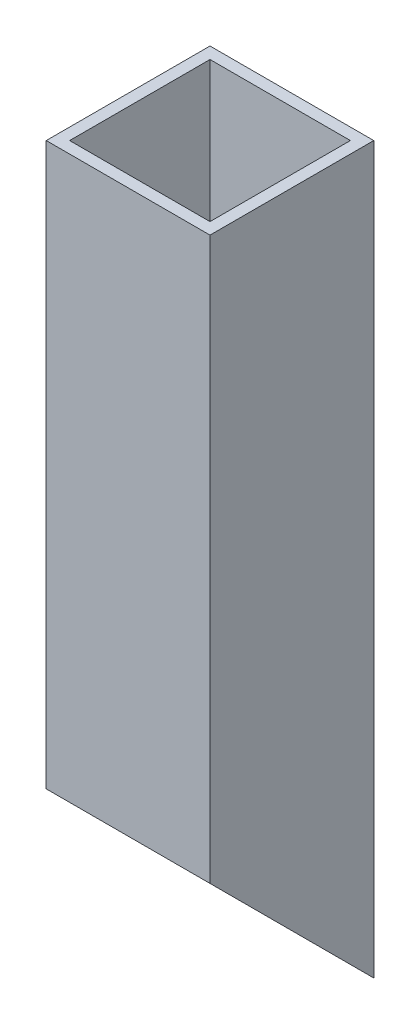
ISO-10303-21;
HEADER;
FILE_DESCRIPTION(('STEP AP214'),'2;1');
FILE_NAME('part.step','',(''),(''),'','','');
FILE_SCHEMA(('AUTOMOTIVE_DESIGN { 1 0 10303 214 1 1 1 1 }'));
ENDSEC;
DATA;
#1=APPLICATION_CONTEXT('core data for automotive mechanical design processes');
#2=APPLICATION_PROTOCOL_DEFINITION('international standard','automotive_design',2000,#1);
#3=PRODUCT_CONTEXT('',#1,'mechanical');
#4=PRODUCT('Part','Part','',(#3));
#5=PRODUCT_RELATED_PRODUCT_CATEGORY('part','',(#4));
#6=PRODUCT_DEFINITION_FORMATION('','',#4);
#7=PRODUCT_DEFINITION_CONTEXT('part definition',#1,'design');
#8=PRODUCT_DEFINITION('design','',#6,#7);
#9=PRODUCT_DEFINITION_SHAPE('','',#8);
#10=(LENGTH_UNIT() NAMED_UNIT(*) SI_UNIT(.MILLI.,.METRE.));
#11=(NAMED_UNIT(*) PLANE_ANGLE_UNIT() SI_UNIT($,.RADIAN.));
#12=(NAMED_UNIT(*) SI_UNIT($,.STERADIAN.) SOLID_ANGLE_UNIT());
#13=UNCERTAINTY_MEASURE_WITH_UNIT(LENGTH_MEASURE(1.E-05),#10,'distance_accuracy_value','');
#14=(GEOMETRIC_REPRESENTATION_CONTEXT(3) GLOBAL_UNCERTAINTY_ASSIGNED_CONTEXT((#13)) GLOBAL_UNIT_ASSIGNED_CONTEXT((#10,
#11,#12)) REPRESENTATION_CONTEXT('',''));
#15=CARTESIAN_POINT('',(0.,0.,0.));
#16=DIRECTION('',(0.,0.,1.));
#17=DIRECTION('',(1.,0.,0.));
#18=AXIS2_PLACEMENT_3D('',#15,#16,#17);
#19=CARTESIAN_POINT('',(0.,196.85,0.));
#20=DIRECTION('',(0.,-1.,0.));
#21=DIRECTION('',(0.,0.,-1.));
#22=AXIS2_PLACEMENT_3D('',#19,#20,#21);
#23=PLANE('',#22);
#24=DIRECTION('',(0.,0.,1.));
#25=VECTOR('',#24,1.);
#26=CARTESIAN_POINT('',(0.,196.85,0.));
#27=LINE('',#26,#25);
#28=CARTESIAN_POINT('',(0.,196.85,-44.45));
#29=VERTEX_POINT('',#28);
#30=CARTESIAN_POINT('',(0.,196.85,0.));
#31=VERTEX_POINT('',#30);
#32=EDGE_CURVE('E124',#29,#31,#27,.T.);
#33=ORIENTED_EDGE('',*,*,#32,.T.);
#34=DIRECTION('',(1.,0.,0.));
#35=VECTOR('',#34,1.);
#36=CARTESIAN_POINT('',(0.,196.85,0.));
#37=LINE('',#36,#35);
#38=CARTESIAN_POINT('',(44.45,196.85,0.));
#39=VERTEX_POINT('',#38);
#40=EDGE_CURVE('E130',#31,#39,#37,.T.);
#41=ORIENTED_EDGE('',*,*,#40,.T.);
#42=DIRECTION('',(0.,0.,-1.));
#43=VECTOR('',#42,1.);
#44=CARTESIAN_POINT('',(44.45,196.85,0.));
#45=LINE('',#44,#43);
#46=CARTESIAN_POINT('',(44.45,196.85,-44.45));
#47=VERTEX_POINT('',#46);
#48=EDGE_CURVE('E127',#39,#47,#45,.T.);
#49=ORIENTED_EDGE('',*,*,#48,.T.);
#50=DIRECTION('',(-1.,0.,0.));
#51=VECTOR('',#50,1.);
#52=CARTESIAN_POINT('',(0.,196.85,-44.45));
#53=LINE('',#52,#51);
#54=EDGE_CURVE('E121',#47,#29,#53,.T.);
#55=ORIENTED_EDGE('',*,*,#54,.T.);
#56=EDGE_LOOP('',(#33,#41,#49,#55));
#57=FACE_BOUND('',#56,.T.);
#58=DIRECTION('',(1.,0.,0.));
#59=VECTOR('',#58,1.);
#60=CARTESIAN_POINT('',(3.175,196.85,-3.175));
#61=LINE('',#60,#59);
#62=CARTESIAN_POINT('',(3.175,196.85,-3.175));
#63=VERTEX_POINT('',#62);
#64=CARTESIAN_POINT('',(41.275,196.85,-3.175));
#65=VERTEX_POINT('',#64);
#66=EDGE_CURVE('E92',#63,#65,#61,.T.);
#67=ORIENTED_EDGE('',*,*,#66,.F.);
#68=DIRECTION('',(0.,0.,1.));
#69=VECTOR('',#68,1.);
#70=CARTESIAN_POINT('',(3.175,196.85,-3.175));
#71=LINE('',#70,#69);
#72=CARTESIAN_POINT('',(3.175,196.85,-41.275));
#73=VERTEX_POINT('',#72);
#74=EDGE_CURVE('E140',#73,#63,#71,.T.);
#75=ORIENTED_EDGE('',*,*,#74,.F.);
#76=DIRECTION('',(-1.,0.,0.));
#77=VECTOR('',#76,1.);
#78=CARTESIAN_POINT('',(3.175,196.85,-41.275));
#79=LINE('',#78,#77);
#80=CARTESIAN_POINT('',(41.275,196.85,-41.275));
#81=VERTEX_POINT('',#80);
#82=EDGE_CURVE('E143',#81,#73,#79,.T.);
#83=ORIENTED_EDGE('',*,*,#82,.F.);
#84=DIRECTION('',(0.,0.,-1.));
#85=VECTOR('',#84,1.);
#86=CARTESIAN_POINT('',(41.275,196.85,-3.175));
#87=LINE('',#86,#85);
#88=EDGE_CURVE('E102',#65,#81,#87,.T.);
#89=ORIENTED_EDGE('',*,*,#88,.F.);
#90=EDGE_LOOP('',(#67,#75,#83,#89));
#91=FACE_BOUND('',#90,.T.);
#92=ADVANCED_FACE('F37',(#57,#91),#23,.F.);
#93=CARTESIAN_POINT('',(0.,196.85,0.));
#94=DIRECTION('',(1.,0.,0.));
#95=DIRECTION('',(0.,0.,-1.));
#96=AXIS2_PLACEMENT_3D('',#93,#94,#95);
#97=PLANE('',#96);
#98=DIRECTION('',(0.,-1.,0.));
#99=VECTOR('',#98,1.);
#100=CARTESIAN_POINT('',(0.,196.85,-44.45));
#101=LINE('',#100,#99);
#102=CARTESIAN_POINT('',(0.,0.,-44.45));
#103=VERTEX_POINT('',#102);
#104=EDGE_CURVE('E119',#29,#103,#101,.T.);
#105=ORIENTED_EDGE('',*,*,#104,.T.);
#106=DIRECTION('',(0.,0.707106781186546,0.707106781186549));
#107=VECTOR('',#106,1.);
#108=CARTESIAN_POINT('',(0.,44.45,0.));
#109=LINE('',#108,#107);
#110=CARTESIAN_POINT('',(0.,44.45,0.));
#111=VERTEX_POINT('',#110);
#112=EDGE_CURVE('E11',#103,#111,#109,.T.);
#113=ORIENTED_EDGE('',*,*,#112,.T.);
#114=DIRECTION('',(0.,-1.,0.));
#115=VECTOR('',#114,1.);
#116=CARTESIAN_POINT('',(0.,196.85,0.));
#117=LINE('',#116,#115);
#118=EDGE_CURVE('E111',#31,#111,#117,.T.);
#119=ORIENTED_EDGE('',*,*,#118,.F.);
#120=ORIENTED_EDGE('',*,*,#32,.F.);
#121=EDGE_LOOP('',(#105,#113,#119,#120));
#122=FACE_BOUND('',#121,.T.);
#123=ADVANCED_FACE('F177',(#122),#97,.F.);
#124=CARTESIAN_POINT('',(0.,196.85,0.));
#125=DIRECTION('',(0.,0.,-1.));
#126=DIRECTION('',(-1.,0.,0.));
#127=AXIS2_PLACEMENT_3D('',#124,#125,#126);
#128=PLANE('',#127);
#129=ORIENTED_EDGE('',*,*,#118,.T.);
#130=DIRECTION('',(1.,0.,0.));
#131=VECTOR('',#130,1.);
#132=CARTESIAN_POINT('',(44.45,44.45,0.));
#133=LINE('',#132,#131);
#134=CARTESIAN_POINT('',(44.45,44.45,0.));
#135=VERTEX_POINT('',#134);
#136=EDGE_CURVE('E108',#111,#135,#133,.T.);
#137=ORIENTED_EDGE('',*,*,#136,.T.);
#138=DIRECTION('',(0.,-1.,0.));
#139=VECTOR('',#138,1.);
#140=CARTESIAN_POINT('',(44.45,196.85,0.));
#141=LINE('',#140,#139);
#142=EDGE_CURVE('E113',#39,#135,#141,.T.);
#143=ORIENTED_EDGE('',*,*,#142,.F.);
#144=ORIENTED_EDGE('',*,*,#40,.F.);
#145=EDGE_LOOP('',(#129,#137,#143,#144));
#146=FACE_BOUND('',#145,.T.);
#147=ADVANCED_FACE('F181',(#146),#128,.F.);
#148=CARTESIAN_POINT('',(44.45,196.85,0.));
#149=DIRECTION('',(-1.,0.,0.));
#150=DIRECTION('',(0.,0.,1.));
#151=AXIS2_PLACEMENT_3D('',#148,#149,#150);
#152=PLANE('',#151);
#153=ORIENTED_EDGE('',*,*,#142,.T.);
#154=DIRECTION('',(0.,-0.707106781186546,-0.707106781186549));
#155=VECTOR('',#154,1.);
#156=CARTESIAN_POINT('',(44.45,44.45,0.));
#157=LINE('',#156,#155);
#158=CARTESIAN_POINT('',(44.45,0.,-44.45));
#159=VERTEX_POINT('',#158);
#160=EDGE_CURVE('E47',#135,#159,#157,.T.);
#161=ORIENTED_EDGE('',*,*,#160,.T.);
#162=DIRECTION('',(0.,-1.,0.));
#163=VECTOR('',#162,1.);
#164=CARTESIAN_POINT('',(44.45,196.85,-44.45));
#165=LINE('',#164,#163);
#166=EDGE_CURVE('E116',#47,#159,#165,.T.);
#167=ORIENTED_EDGE('',*,*,#166,.F.);
#168=ORIENTED_EDGE('',*,*,#48,.F.);
#169=EDGE_LOOP('',(#153,#161,#167,#168));
#170=FACE_BOUND('',#169,.T.);
#171=ADVANCED_FACE('F184',(#170),#152,.F.);
#172=CARTESIAN_POINT('',(0.,196.85,-44.45));
#173=DIRECTION('',(0.,0.,1.));
#174=DIRECTION('',(1.,0.,0.));
#175=AXIS2_PLACEMENT_3D('',#172,#173,#174);
#176=PLANE('',#175);
#177=DIRECTION('',(-1.,0.,0.));
#178=VECTOR('',#177,1.);
#179=CARTESIAN_POINT('',(0.,0.,-44.45));
#180=LINE('',#179,#178);
#181=EDGE_CURVE('E93',#159,#103,#180,.T.);
#182=ORIENTED_EDGE('',*,*,#181,.T.);
#183=ORIENTED_EDGE('',*,*,#104,.F.);
#184=ORIENTED_EDGE('',*,*,#54,.F.);
#185=ORIENTED_EDGE('',*,*,#166,.T.);
#186=EDGE_LOOP('',(#182,#183,#184,#185));
#187=FACE_BOUND('',#186,.T.);
#188=ADVANCED_FACE('F172',(#187),#176,.F.);
#189=CARTESIAN_POINT('',(3.175,196.85,-3.175));
#190=DIRECTION('',(0.,0.,-1.));
#191=DIRECTION('',(-1.,0.,0.));
#192=AXIS2_PLACEMENT_3D('',#189,#190,#191);
#193=PLANE('',#192);
#194=DIRECTION('',(1.,0.,0.));
#195=VECTOR('',#194,1.);
#196=CARTESIAN_POINT('',(0.,41.275,-3.175));
#197=LINE('',#196,#195);
#198=CARTESIAN_POINT('',(3.175,41.275,-3.175));
#199=VERTEX_POINT('',#198);
#200=CARTESIAN_POINT('',(41.275,41.275,-3.175));
#201=VERTEX_POINT('',#200);
#202=EDGE_CURVE('E41',#199,#201,#197,.T.);
#203=ORIENTED_EDGE('',*,*,#202,.F.);
#204=DIRECTION('',(0.,-1.,0.));
#205=VECTOR('',#204,1.);
#206=CARTESIAN_POINT('',(3.175,196.85,-3.175));
#207=LINE('',#206,#205);
#208=EDGE_CURVE('E138',#63,#199,#207,.T.);
#209=ORIENTED_EDGE('',*,*,#208,.F.);
#210=ORIENTED_EDGE('',*,*,#66,.T.);
#211=DIRECTION('',(0.,-1.,0.));
#212=VECTOR('',#211,1.);
#213=CARTESIAN_POINT('',(41.275,196.85,-3.175));
#214=LINE('',#213,#212);
#215=EDGE_CURVE('E76',#65,#201,#214,.T.);
#216=ORIENTED_EDGE('',*,*,#215,.T.);
#217=EDGE_LOOP('',(#203,#209,#210,#216));
#218=FACE_BOUND('',#217,.T.);
#219=ADVANCED_FACE('F88',(#218),#193,.T.);
#220=CARTESIAN_POINT('',(41.275,196.85,-3.175));
#221=DIRECTION('',(-1.,0.,0.));
#222=DIRECTION('',(0.,0.,1.));
#223=AXIS2_PLACEMENT_3D('',#220,#221,#222);
#224=PLANE('',#223);
#225=DIRECTION('',(0.,-0.707106781186546,-0.707106781186549));
#226=VECTOR('',#225,1.);
#227=CARTESIAN_POINT('',(41.275,44.45,0.));
#228=LINE('',#227,#226);
#229=CARTESIAN_POINT('',(41.275,3.17500000000018,-41.275));
#230=VERTEX_POINT('',#229);
#231=EDGE_CURVE('E72',#201,#230,#228,.T.);
#232=ORIENTED_EDGE('',*,*,#231,.F.);
#233=ORIENTED_EDGE('',*,*,#215,.F.);
#234=ORIENTED_EDGE('',*,*,#88,.T.);
#235=DIRECTION('',(0.,-1.,0.));
#236=VECTOR('',#235,1.);
#237=CARTESIAN_POINT('',(41.275,196.85,-41.275));
#238=LINE('',#237,#236);
#239=EDGE_CURVE('E79',#81,#230,#238,.T.);
#240=ORIENTED_EDGE('',*,*,#239,.T.);
#241=EDGE_LOOP('',(#232,#233,#234,#240));
#242=FACE_BOUND('',#241,.T.);
#243=ADVANCED_FACE('F74',(#242),#224,.T.);
#244=CARTESIAN_POINT('',(3.175,196.85,-41.275));
#245=DIRECTION('',(0.,0.,1.));
#246=DIRECTION('',(1.,0.,0.));
#247=AXIS2_PLACEMENT_3D('',#244,#245,#246);
#248=PLANE('',#247);
#249=DIRECTION('',(-1.,0.,0.));
#250=VECTOR('',#249,1.);
#251=CARTESIAN_POINT('',(0.,3.17500000000015,-41.275));
#252=LINE('',#251,#250);
#253=CARTESIAN_POINT('',(3.175,3.17500000000018,-41.275));
#254=VERTEX_POINT('',#253);
#255=EDGE_CURVE('E84',#230,#254,#252,.T.);
#256=ORIENTED_EDGE('',*,*,#255,.F.);
#257=ORIENTED_EDGE('',*,*,#239,.F.);
#258=ORIENTED_EDGE('',*,*,#82,.T.);
#259=DIRECTION('',(0.,-1.,0.));
#260=VECTOR('',#259,1.);
#261=CARTESIAN_POINT('',(3.175,196.85,-41.275));
#262=LINE('',#261,#260);
#263=EDGE_CURVE('E136',#73,#254,#262,.T.);
#264=ORIENTED_EDGE('',*,*,#263,.T.);
#265=EDGE_LOOP('',(#256,#257,#258,#264));
#266=FACE_BOUND('',#265,.T.);
#267=ADVANCED_FACE('F152',(#266),#248,.T.);
#268=CARTESIAN_POINT('',(3.175,196.85,-3.175));
#269=DIRECTION('',(1.,0.,0.));
#270=DIRECTION('',(0.,0.,-1.));
#271=AXIS2_PLACEMENT_3D('',#268,#269,#270);
#272=PLANE('',#271);
#273=DIRECTION('',(0.,0.707106781186546,0.707106781186549));
#274=VECTOR('',#273,1.);
#275=CARTESIAN_POINT('',(3.175,44.45,0.));
#276=LINE('',#275,#274);
#277=EDGE_CURVE('E97',#254,#199,#276,.T.);
#278=ORIENTED_EDGE('',*,*,#277,.F.);
#279=ORIENTED_EDGE('',*,*,#263,.F.);
#280=ORIENTED_EDGE('',*,*,#74,.T.);
#281=ORIENTED_EDGE('',*,*,#208,.T.);
#282=EDGE_LOOP('',(#278,#279,#280,#281));
#283=FACE_BOUND('',#282,.T.);
#284=ADVANCED_FACE('F154',(#283),#272,.T.);
#285=CARTESIAN_POINT('',(0.,44.45,0.));
#286=DIRECTION('',(0.,-0.707106781186549,0.707106781186546));
#287=DIRECTION('',(-1.,0.,0.));
#288=AXIS2_PLACEMENT_3D('',#285,#286,#287);
#289=PLANE('',#288);
#290=ORIENTED_EDGE('',*,*,#112,.F.);
#291=ORIENTED_EDGE('',*,*,#181,.F.);
#292=ORIENTED_EDGE('',*,*,#160,.F.);
#293=ORIENTED_EDGE('',*,*,#136,.F.);
#294=EDGE_LOOP('',(#290,#291,#292,#293));
#295=FACE_BOUND('',#294,.T.);
#296=ORIENTED_EDGE('',*,*,#277,.T.);
#297=ORIENTED_EDGE('',*,*,#202,.T.);
#298=ORIENTED_EDGE('',*,*,#231,.T.);
#299=ORIENTED_EDGE('',*,*,#255,.T.);
#300=EDGE_LOOP('',(#296,#297,#298,#299));
#301=FACE_BOUND('',#300,.T.);
#302=ADVANCED_FACE('F39',(#295,#301),#289,.T.);
#303=CLOSED_SHELL('',(#92,#123,#147,#171,#188,#219,#243,#267,#284,#302));
#304=MANIFOLD_SOLID_BREP('B2',#303);
#305=ADVANCED_BREP_SHAPE_REPRESENTATION('',(#18,#304),#14);
#306=SHAPE_DEFINITION_REPRESENTATION(#9,#305);
ENDSEC;
END-ISO-10303-21;
